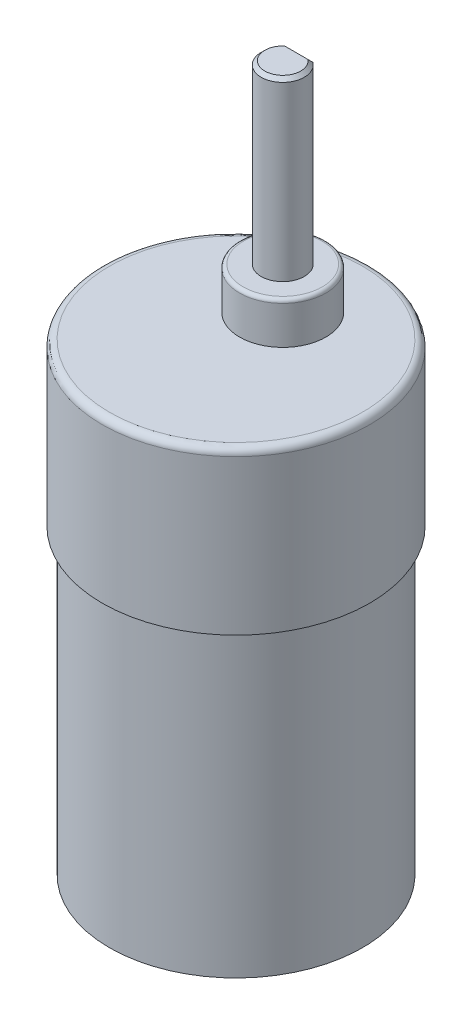
ISO-10303-21;
HEADER;
FILE_DESCRIPTION(('STEP AP214'),'2;1');
FILE_NAME('part.step','',(''),(''),'','','');
FILE_SCHEMA(('AUTOMOTIVE_DESIGN { 1 0 10303 214 1 1 1 1 }'));
ENDSEC;
DATA;
#1=APPLICATION_CONTEXT('core data for automotive mechanical design processes');
#2=APPLICATION_PROTOCOL_DEFINITION('international standard','automotive_design',2000,#1);
#3=PRODUCT_CONTEXT('',#1,'mechanical');
#4=PRODUCT('Part','Part','',(#3));
#5=PRODUCT_RELATED_PRODUCT_CATEGORY('part','',(#4));
#6=PRODUCT_DEFINITION_FORMATION('','',#4);
#7=PRODUCT_DEFINITION_CONTEXT('part definition',#1,'design');
#8=PRODUCT_DEFINITION('design','',#6,#7);
#9=PRODUCT_DEFINITION_SHAPE('','',#8);
#10=(LENGTH_UNIT() NAMED_UNIT(*) SI_UNIT(.MILLI.,.METRE.));
#11=(NAMED_UNIT(*) PLANE_ANGLE_UNIT() SI_UNIT($,.RADIAN.));
#12=(NAMED_UNIT(*) SI_UNIT($,.STERADIAN.) SOLID_ANGLE_UNIT());
#13=UNCERTAINTY_MEASURE_WITH_UNIT(LENGTH_MEASURE(1.E-05),#10,'distance_accuracy_value','');
#14=(GEOMETRIC_REPRESENTATION_CONTEXT(3) GLOBAL_UNCERTAINTY_ASSIGNED_CONTEXT((#13)) GLOBAL_UNIT_ASSIGNED_CONTEXT((#10,
#11,#12)) REPRESENTATION_CONTEXT('',''));
#15=CARTESIAN_POINT('',(0.,0.,0.));
#16=DIRECTION('',(0.,0.,1.));
#17=DIRECTION('',(1.,0.,0.));
#18=AXIS2_PLACEMENT_3D('',#15,#16,#17);
#19=CARTESIAN_POINT('',(9.03438594613245,-46.,-9.8));
#20=DIRECTION('',(0.931562549804886,0.,0.363581099345139));
#21=DIRECTION('',(0.363581099345139,0.,-0.931562549804886));
#22=AXIS2_PLACEMENT_3D('',#19,#20,#21);
#23=PLANE('',#22);
#24=DIRECTION('',(0.363581099345139,0.,-0.931562549804886));
#25=VECTOR('',#24,1.);
#26=CARTESIAN_POINT('',(9.03438594613245,-46.,-9.8));
#27=LINE('',#26,#25);
#28=CARTESIAN_POINT('',(8.12543319776952,-46.,-7.47109362548758));
#29=VERTEX_POINT('',#28);
#30=CARTESIAN_POINT('',(8.85259539645988,-46.,-9.33421872509756));
#31=VERTEX_POINT('',#30);
#32=EDGE_CURVE('E207',#29,#31,#27,.T.);
#33=ORIENTED_EDGE('',*,*,#32,.F.);
#34=DIRECTION('',(0.257090660858204,-0.707106781186558,-0.658714196066456));
#35=VECTOR('',#34,1.);
#36=CARTESIAN_POINT('',(8.12543319776952,-46.,-7.47109362548758));
#37=LINE('',#36,#35);
#38=CARTESIAN_POINT('',(7.94364264809696,-45.5,-7.00531235058515));
#39=VERTEX_POINT('',#38);
#40=EDGE_CURVE('E290',#29,#39,#37,.F.);
#41=ORIENTED_EDGE('',*,*,#40,.T.);
#42=DIRECTION('',(0.,1.,0.));
#43=VECTOR('',#42,1.);
#44=CARTESIAN_POINT('',(7.94364264809696,-46.,-7.00531235058515));
#45=LINE('',#44,#43);
#46=CARTESIAN_POINT('',(7.94364264809696,-41.,-7.00531235058515));
#47=VERTEX_POINT('',#46);
#48=EDGE_CURVE('E185',#39,#47,#45,.T.);
#49=ORIENTED_EDGE('',*,*,#48,.T.);
#50=DIRECTION('',(0.363581099345139,0.,-0.931562549804886));
#51=VECTOR('',#50,1.);
#52=CARTESIAN_POINT('',(9.03438594613245,-41.,-9.8));
#53=LINE('',#52,#51);
#54=CARTESIAN_POINT('',(9.03438594613245,-41.,-9.8));
#55=VERTEX_POINT('',#54);
#56=EDGE_CURVE('E181',#47,#55,#53,.T.);
#57=ORIENTED_EDGE('',*,*,#56,.T.);
#58=DIRECTION('',(0.,1.,0.));
#59=VECTOR('',#58,1.);
#60=CARTESIAN_POINT('',(9.03438594613245,-46.,-9.8));
#61=LINE('',#60,#59);
#62=CARTESIAN_POINT('',(9.03438594613245,-45.5,-9.8));
#63=VERTEX_POINT('',#62);
#64=EDGE_CURVE('E165',#63,#55,#61,.T.);
#65=ORIENTED_EDGE('',*,*,#64,.F.);
#66=DIRECTION('',(0.257090660858206,0.707106781186553,-0.65871419606646));
#67=VECTOR('',#66,1.);
#68=CARTESIAN_POINT('',(8.85259539645988,-46.,-9.33421872509756));
#69=LINE('',#68,#67);
#70=EDGE_CURVE('E287',#63,#31,#69,.F.);
#71=ORIENTED_EDGE('',*,*,#70,.T.);
#72=EDGE_LOOP('',(#33,#41,#49,#57,#65,#71));
#73=FACE_BOUND('',#72,.T.);
#74=CARTESIAN_POINT('',(8.48901429711467,-45.,-8.40265617529258));
#75=DIRECTION('',(0.931562549804886,0.,0.363581099345139));
#76=DIRECTION('',(0.363581099345139,0.,-0.931562549804886));
#77=AXIS2_PLACEMENT_3D('',#74,#75,#76);
#78=CIRCLE('',#77,0.500000000000004);
#79=CARTESIAN_POINT('',(8.67080484678724,-45.,-8.86843745019503));
#80=VERTEX_POINT('',#79);
#81=EDGE_CURVE('E519',#80,#80,#78,.T.);
#82=ORIENTED_EDGE('',*,*,#81,.T.);
#83=EDGE_LOOP('',(#82));
#84=FACE_BOUND('',#83,.T.);
#85=ADVANCED_FACE('F16',(#73,#84),#23,.F.);
#86=CARTESIAN_POINT('',(8.4094239229994,-46.,-6.82352180091257));
#87=DIRECTION('',(-0.931562549804876,0.,-0.363581099345163));
#88=DIRECTION('',(-0.363581099345163,0.,0.931562549804876));
#89=AXIS2_PLACEMENT_3D('',#86,#87,#88);
#90=PLANE('',#89);
#91=DIRECTION('',(0.,1.,0.));
#92=VECTOR('',#91,1.);
#93=CARTESIAN_POINT('',(8.4094239229994,-46.,-6.82352180091257));
#94=LINE('',#93,#92);
#95=CARTESIAN_POINT('',(8.4094239229994,-45.5,-6.82352180091257));
#96=VERTEX_POINT('',#95);
#97=CARTESIAN_POINT('',(8.4094239229994,-41.,-6.82352180091257));
#98=VERTEX_POINT('',#97);
#99=EDGE_CURVE('E210',#96,#98,#94,.T.);
#100=ORIENTED_EDGE('',*,*,#99,.F.);
#101=DIRECTION('',(-0.257090660858221,0.707106781186557,0.65871419606645));
#102=VECTOR('',#101,1.);
#103=CARTESIAN_POINT('',(8.59121447267197,-46.,-7.28930307581499));
#104=LINE('',#103,#102);
#105=CARTESIAN_POINT('',(8.59121447267197,-46.,-7.28930307581499));
#106=VERTEX_POINT('',#105);
#107=EDGE_CURVE('E298',#96,#106,#104,.F.);
#108=ORIENTED_EDGE('',*,*,#107,.T.);
#109=DIRECTION('',(-0.363581099345163,0.,0.931562549804876));
#110=VECTOR('',#109,1.);
#111=CARTESIAN_POINT('',(8.4094239229994,-46.,-6.82352180091257));
#112=LINE('',#111,#110);
#113=CARTESIAN_POINT('',(9.31837667136231,-46.,-9.15242817542476));
#114=VERTEX_POINT('',#113);
#115=EDGE_CURVE('E211',#114,#106,#112,.T.);
#116=ORIENTED_EDGE('',*,*,#115,.F.);
#117=DIRECTION('',(-0.257090660858222,-0.707106781186553,0.658714196066453));
#118=VECTOR('',#117,1.);
#119=CARTESIAN_POINT('',(9.31837667136235,-45.9999999999999,-9.15242817542486));
#120=LINE('',#119,#118);
#121=CARTESIAN_POINT('',(9.50016722103489,-45.5,-9.6182094503272));
#122=VERTEX_POINT('',#121);
#123=EDGE_CURVE('E295',#114,#122,#120,.F.);
#124=ORIENTED_EDGE('',*,*,#123,.T.);
#125=DIRECTION('',(0.,1.,0.));
#126=VECTOR('',#125,1.);
#127=CARTESIAN_POINT('',(9.50016722103489,-46.,-9.6182094503272));
#128=LINE('',#127,#126);
#129=CARTESIAN_POINT('',(9.50016722103489,-41.,-9.6182094503272));
#130=VERTEX_POINT('',#129);
#131=EDGE_CURVE('E178',#122,#130,#128,.T.);
#132=ORIENTED_EDGE('',*,*,#131,.T.);
#133=DIRECTION('',(-0.363581099345163,0.,0.931562549804876));
#134=VECTOR('',#133,1.);
#135=CARTESIAN_POINT('',(8.4094239229994,-41.,-6.82352180091257));
#136=LINE('',#135,#134);
#137=EDGE_CURVE('E194',#130,#98,#136,.T.);
#138=ORIENTED_EDGE('',*,*,#137,.T.);
#139=EDGE_LOOP('',(#100,#108,#116,#124,#132,#138));
#140=FACE_BOUND('',#139,.T.);
#141=CARTESIAN_POINT('',(8.95479557201718,-45.,-8.22086562561998));
#142=DIRECTION('',(-0.931562549804876,0.,-0.363581099345163));
#143=DIRECTION('',(-0.363581099345163,0.,0.931562549804876));
#144=AXIS2_PLACEMENT_3D('',#141,#142,#143);
#145=CIRCLE('',#144,0.500000000000004);
#146=CARTESIAN_POINT('',(8.7730050223446,-45.,-7.75508435071754));
#147=VERTEX_POINT('',#146);
#148=EDGE_CURVE('E522',#147,#147,#145,.F.);
#149=ORIENTED_EDGE('',*,*,#148,.F.);
#150=EDGE_LOOP('',(#149));
#151=FACE_BOUND('',#150,.T.);
#152=ADVANCED_FACE('F393',(#140,#151),#90,.F.);
#153=CARTESIAN_POINT('',(0.,52.8,-6.5));
#154=DIRECTION('',(0.,-1.,0.));
#155=DIRECTION('',(0.,0.,-1.));
#156=AXIS2_PLACEMENT_3D('',#153,#154,#155);
#157=CYLINDRICAL_SURFACE('',#156,3.);
#158=DIRECTION('',(0.,-1.,0.));
#159=VECTOR('',#158,1.);
#160=CARTESIAN_POINT('',(1.8,52.8,-8.9));
#161=LINE('',#160,#159);
#162=CARTESIAN_POINT('',(1.8,52.3,-8.9));
#163=VERTEX_POINT('',#162);
#164=CARTESIAN_POINT('',(1.79999999999999,28.3,-8.9));
#165=VERTEX_POINT('',#164);
#166=EDGE_CURVE('E365',#163,#165,#161,.T.);
#167=ORIENTED_EDGE('',*,*,#166,.F.);
#168=CARTESIAN_POINT('',(0.,52.3,-6.5));
#169=DIRECTION('',(0.,1.,0.));
#170=DIRECTION('',(0.,0.,1.));
#171=AXIS2_PLACEMENT_3D('',#168,#169,#170);
#172=CIRCLE('',#171,3.);
#173=CARTESIAN_POINT('',(-1.8,52.3,-8.9));
#174=VERTEX_POINT('',#173);
#175=EDGE_CURVE('E10',#163,#174,#172,.F.);
#176=ORIENTED_EDGE('',*,*,#175,.T.);
#177=DIRECTION('',(0.,-1.,0.));
#178=VECTOR('',#177,1.);
#179=CARTESIAN_POINT('',(-1.8,52.8,-8.9));
#180=LINE('',#179,#178);
#181=CARTESIAN_POINT('',(-1.8,28.3,-8.9));
#182=VERTEX_POINT('',#181);
#183=EDGE_CURVE('E362',#174,#182,#180,.T.);
#184=ORIENTED_EDGE('',*,*,#183,.T.);
#185=CARTESIAN_POINT('',(0.,28.3,-6.5));
#186=DIRECTION('',(0.,1.,0.));
#187=DIRECTION('',(0.,0.,1.));
#188=AXIS2_PLACEMENT_3D('',#185,#186,#187);
#189=CIRCLE('',#188,3.);
#190=EDGE_CURVE('E354',#182,#165,#189,.T.);
#191=ORIENTED_EDGE('',*,*,#190,.T.);
#192=EDGE_LOOP('',(#167,#176,#184,#191));
#193=FACE_BOUND('',#192,.T.);
#194=ADVANCED_FACE('F388',(#193),#157,.T.);
#195=CARTESIAN_POINT('',(-1.8,52.8,-8.9));
#196=DIRECTION('',(0.,0.,1.));
#197=DIRECTION('',(1.,0.,0.));
#198=AXIS2_PLACEMENT_3D('',#195,#196,#197);
#199=PLANE('',#198);
#200=ORIENTED_EDGE('',*,*,#183,.F.);
#201=DIRECTION('',(1.,0.,0.));
#202=VECTOR('',#201,1.);
#203=CARTESIAN_POINT('',(1.8,52.3,-8.9));
#204=LINE('',#203,#202);
#205=EDGE_CURVE('E30',#174,#163,#204,.T.);
#206=ORIENTED_EDGE('',*,*,#205,.T.);
#207=ORIENTED_EDGE('',*,*,#166,.T.);
#208=DIRECTION('',(-1.,0.,0.));
#209=VECTOR('',#208,1.);
#210=CARTESIAN_POINT('',(-1.8,28.3,-8.9));
#211=LINE('',#210,#209);
#212=EDGE_CURVE('E358',#165,#182,#211,.T.);
#213=ORIENTED_EDGE('',*,*,#212,.T.);
#214=EDGE_LOOP('',(#200,#206,#207,#213));
#215=FACE_BOUND('',#214,.T.);
#216=ADVANCED_FACE('F392',(#215),#199,.F.);
#217=CARTESIAN_POINT('',(0.,52.8,-6.5));
#218=DIRECTION('',(0.,1.,0.));
#219=DIRECTION('',(0.,0.,1.));
#220=AXIS2_PLACEMENT_3D('',#217,#218,#219);
#221=PLANE('',#220);
#222=CARTESIAN_POINT('',(0.,52.8,-6.5));
#223=DIRECTION('',(0.,1.,0.));
#224=DIRECTION('',(0.,0.,1.));
#225=AXIS2_PLACEMENT_3D('',#222,#223,#224);
#226=CIRCLE('',#225,2.5);
#227=CARTESIAN_POINT('',(-1.62480768092719,52.8,-8.4));
#228=VERTEX_POINT('',#227);
#229=CARTESIAN_POINT('',(1.62480768092719,52.8,-8.4));
#230=VERTEX_POINT('',#229);
#231=EDGE_CURVE('E369',#228,#230,#226,.T.);
#232=ORIENTED_EDGE('',*,*,#231,.T.);
#233=DIRECTION('',(-1.,0.,0.));
#234=VECTOR('',#233,1.);
#235=CARTESIAN_POINT('',(-1.8,52.8,-8.4));
#236=LINE('',#235,#234);
#237=EDGE_CURVE('E372',#230,#228,#236,.T.);
#238=ORIENTED_EDGE('',*,*,#237,.T.);
#239=EDGE_LOOP('',(#232,#238));
#240=FACE_BOUND('',#239,.T.);
#241=ADVANCED_FACE('F386',(#240),#221,.T.);
#242=CARTESIAN_POINT('',(0.,52.8,-6.5));
#243=DIRECTION('',(0.,-1.,0.));
#244=DIRECTION('',(0.,0.,-1.));
#245=AXIS2_PLACEMENT_3D('',#242,#243,#244);
#246=CONICAL_SURFACE('',#245,2.5,0.785398163397443);
#247=CARTESIAN_POINT('',(-1.62480768092719,52.8,-8.4));
#248=CARTESIAN_POINT('',(-1.65541292897536,52.7169127929639,-8.48308720703609));
#249=CARTESIAN_POINT('',(-1.68531495795293,52.6337023873582,-8.56629761264177));
#250=CARTESIAN_POINT('',(-1.74371238852874,52.4670357190947,-8.73296428090534));
#251=CARTESIAN_POINT('',(-1.7722077992421,52.3835794580337,-8.81642054196633));
#252=CARTESIAN_POINT('',(-1.8,52.3,-8.9));
#253=B_SPLINE_CURVE_WITH_KNOTS('',3,(#247,#248,#249,#250,#251,#252),.UNSPECIFIED.,.F.,.F.,(4,2,
4),(0.,0.36425083507371,0.728499309429532),.UNSPECIFIED.);
#254=EDGE_CURVE('E353',#174,#228,#253,.F.);
#255=ORIENTED_EDGE('',*,*,#254,.F.);
#256=ORIENTED_EDGE('',*,*,#175,.F.);
#257=CARTESIAN_POINT('',(1.8,52.3,-8.9));
#258=CARTESIAN_POINT('',(1.7722077992421,52.3835794580337,-8.81642054196633));
#259=CARTESIAN_POINT('',(1.74371238852874,52.4670357190947,-8.73296428090534));
#260=CARTESIAN_POINT('',(1.68531495795293,52.6337023873582,-8.56629761264177));
#261=CARTESIAN_POINT('',(1.65541292897536,52.7169127929639,-8.48308720703609));
#262=CARTESIAN_POINT('',(1.62480768092719,52.8,-8.4));
#263=B_SPLINE_CURVE_WITH_KNOTS('',3,(#257,#258,#259,#260,#261,#262),.UNSPECIFIED.,.F.,.F.,(4,2,
4),(0.,0.364248474355822,0.728499309429532),.UNSPECIFIED.);
#264=EDGE_CURVE('E21',#230,#163,#263,.F.);
#265=ORIENTED_EDGE('',*,*,#264,.F.);
#266=ORIENTED_EDGE('',*,*,#231,.F.);
#267=EDGE_LOOP('',(#255,#256,#265,#266));
#268=FACE_BOUND('',#267,.T.);
#269=ADVANCED_FACE('F382',(#268),#246,.T.);
#270=CARTESIAN_POINT('',(0.,52.8,-8.4));
#271=DIRECTION('',(0.,0.707106781186544,-0.707106781186551));
#272=DIRECTION('',(0.,0.707106781186551,0.707106781186544));
#273=AXIS2_PLACEMENT_3D('',#270,#271,#272);
#274=PLANE('',#273);
#275=ORIENTED_EDGE('',*,*,#264,.T.);
#276=ORIENTED_EDGE('',*,*,#205,.F.);
#277=ORIENTED_EDGE('',*,*,#254,.T.);
#278=ORIENTED_EDGE('',*,*,#237,.F.);
#279=EDGE_LOOP('',(#275,#276,#277,#278));
#280=FACE_BOUND('',#279,.T.);
#281=ADVANCED_FACE('F18',(#280),#274,.T.);
#282=CARTESIAN_POINT('',(0.,28.3,-6.5));
#283=DIRECTION('',(0.,1.,0.));
#284=DIRECTION('',(0.,0.,1.));
#285=AXIS2_PLACEMENT_3D('',#282,#283,#284);
#286=PLANE('',#285);
#287=CARTESIAN_POINT('',(0.,28.3,-6.5));
#288=DIRECTION('',(0.,1.,0.));
#289=DIRECTION('',(0.,0.,1.));
#290=AXIS2_PLACEMENT_3D('',#287,#288,#289);
#291=CIRCLE('',#290,5.5);
#292=CARTESIAN_POINT('',(0.,28.3,-0.999999999999998));
#293=VERTEX_POINT('',#292);
#294=EDGE_CURVE('E337',#293,#293,#291,.T.);
#295=ORIENTED_EDGE('',*,*,#294,.T.);
#296=EDGE_LOOP('',(#295));
#297=FACE_BOUND('',#296,.T.);
#298=ORIENTED_EDGE('',*,*,#190,.F.);
#299=ORIENTED_EDGE('',*,*,#212,.F.);
#300=EDGE_LOOP('',(#298,#299));
#301=FACE_BOUND('',#300,.T.);
#302=ADVANCED_FACE('F447',(#297,#301),#286,.T.);
#303=CARTESIAN_POINT('',(0.,-41.,0.));
#304=DIRECTION('',(0.,-1.,0.));
#305=DIRECTION('',(0.,0.,-1.));
#306=AXIS2_PLACEMENT_3D('',#303,#304,#305);
#307=PLANE('',#306);
#308=DIRECTION('',(-0.931562549804876,0.,0.363581099345164));
#309=VECTOR('',#308,1.);
#310=CARTESIAN_POINT('',(-8.40942392299948,-41.,-6.82352180091257));
#311=LINE('',#310,#309);
#312=CARTESIAN_POINT('',(-7.94364264809704,-41.,-7.00531235058515));
#313=VERTEX_POINT('',#312);
#314=CARTESIAN_POINT('',(-8.40942392299948,-41.,-6.82352180091257));
#315=VERTEX_POINT('',#314);
#316=EDGE_CURVE('E229',#313,#315,#311,.T.);
#317=ORIENTED_EDGE('',*,*,#316,.F.);
#318=DIRECTION('',(0.363581099345165,0.,0.931562549804876));
#319=VECTOR('',#318,1.);
#320=CARTESIAN_POINT('',(-7.94364264809704,-41.,-7.00531235058515));
#321=LINE('',#320,#319);
#322=CARTESIAN_POINT('',(-9.03438594613253,-41.,-9.79999999999979));
#323=VERTEX_POINT('',#322);
#324=EDGE_CURVE('E177',#323,#313,#321,.T.);
#325=ORIENTED_EDGE('',*,*,#324,.F.);
#326=DIRECTION('',(0.931562549804854,0.,-0.36358109934522));
#327=VECTOR('',#326,1.);
#328=CARTESIAN_POINT('',(-9.03438594613253,-41.,-9.79999999999979));
#329=LINE('',#328,#327);
#330=CARTESIAN_POINT('',(-9.50016722103496,-41.,-9.61820945032717));
#331=VERTEX_POINT('',#330);
#332=EDGE_CURVE('E221',#331,#323,#329,.T.);
#333=ORIENTED_EDGE('',*,*,#332,.F.);
#334=DIRECTION('',(-0.363581099345165,0.,-0.931562549804876));
#335=VECTOR('',#334,1.);
#336=CARTESIAN_POINT('',(-9.50016722103496,-41.,-9.61820945032718));
#337=LINE('',#336,#335);
#338=EDGE_CURVE('E233',#315,#331,#337,.T.);
#339=ORIENTED_EDGE('',*,*,#338,.F.);
#340=EDGE_LOOP('',(#317,#325,#333,#339));
#341=FACE_BOUND('',#340,.T.);
#342=CARTESIAN_POINT('',(0.,-41.,0.));
#343=DIRECTION('',(0.,-1.,0.));
#344=DIRECTION('',(0.,0.,-1.));
#345=AXIS2_PLACEMENT_3D('',#342,#343,#344);
#346=CIRCLE('',#345,17.);
#347=CARTESIAN_POINT('',(0.,-41.,-17.));
#348=VERTEX_POINT('',#347);
#349=EDGE_CURVE('E256',#348,#348,#346,.T.);
#350=ORIENTED_EDGE('',*,*,#349,.T.);
#351=EDGE_LOOP('',(#350));
#352=FACE_BOUND('',#351,.T.);
#353=CARTESIAN_POINT('',(0.,-41.,0.));
#354=DIRECTION('',(0.,-1.,0.));
#355=DIRECTION('',(0.,0.,-1.));
#356=AXIS2_PLACEMENT_3D('',#353,#354,#355);
#357=CIRCLE('',#356,4.9);
#358=CARTESIAN_POINT('',(0.,-41.,-4.9));
#359=VERTEX_POINT('',#358);
#360=EDGE_CURVE('E251',#359,#359,#357,.T.);
#361=ORIENTED_EDGE('',*,*,#360,.F.);
#362=EDGE_LOOP('',(#361));
#363=FACE_BOUND('',#362,.T.);
#364=DIRECTION('',(0.931562549804728,0.,0.363581099345543));
#365=VECTOR('',#364,1.);
#366=CARTESIAN_POINT('',(9.50016722103489,-41.,-9.6182094503272));
#367=LINE('',#366,#365);
#368=EDGE_CURVE('E170',#55,#130,#367,.T.);
#369=ORIENTED_EDGE('',*,*,#368,.F.);
#370=ORIENTED_EDGE('',*,*,#56,.F.);
#371=DIRECTION('',(-0.931562549804877,0.,-0.363581099345161));
#372=VECTOR('',#371,1.);
#373=CARTESIAN_POINT('',(7.94364264809696,-41.,-7.00531235058515));
#374=LINE('',#373,#372);
#375=EDGE_CURVE('E201',#98,#47,#374,.T.);
#376=ORIENTED_EDGE('',*,*,#375,.F.);
#377=ORIENTED_EDGE('',*,*,#137,.F.);
#378=EDGE_LOOP('',(#369,#370,#376,#377));
#379=FACE_BOUND('',#378,.T.);
#380=ADVANCED_FACE('F192',(#341,#352,#363,#379),#307,.T.);
#381=CARTESIAN_POINT('',(0.,0.,0.));
#382=DIRECTION('',(0.,1.,0.));
#383=DIRECTION('',(0.,0.,1.));
#384=AXIS2_PLACEMENT_3D('',#381,#382,#383);
#385=PLANE('',#384);
#386=CARTESIAN_POINT('',(0.,0.,0.));
#387=DIRECTION('',(0.,1.,0.));
#388=DIRECTION('',(0.,0.,1.));
#389=AXIS2_PLACEMENT_3D('',#386,#387,#388);
#390=CIRCLE('',#389,18.6);
#391=CARTESIAN_POINT('',(0.,0.,18.6));
#392=VERTEX_POINT('',#391);
#393=EDGE_CURVE('E271',#392,#392,#390,.T.);
#394=ORIENTED_EDGE('',*,*,#393,.F.);
#395=EDGE_LOOP('',(#394));
#396=FACE_BOUND('',#395,.T.);
#397=CARTESIAN_POINT('',(0.,0.,0.));
#398=DIRECTION('',(0.,1.,0.));
#399=DIRECTION('',(0.,0.,1.));
#400=AXIS2_PLACEMENT_3D('',#397,#398,#399);
#401=CIRCLE('',#400,17.6);
#402=CARTESIAN_POINT('',(0.,0.,17.6));
#403=VERTEX_POINT('',#402);
#404=EDGE_CURVE('E275',#403,#403,#401,.F.);
#405=ORIENTED_EDGE('',*,*,#404,.F.);
#406=EDGE_LOOP('',(#405));
#407=FACE_BOUND('',#406,.T.);
#408=ADVANCED_FACE('F436',(#396,#407),#385,.F.);
#409=CARTESIAN_POINT('',(0.,22.5,0.));
#410=DIRECTION('',(0.,1.,0.));
#411=DIRECTION('',(0.,0.,1.));
#412=AXIS2_PLACEMENT_3D('',#409,#410,#411);
#413=PLANE('',#412);
#414=CARTESIAN_POINT('',(0.,22.5,0.));
#415=DIRECTION('',(0.,1.,0.));
#416=DIRECTION('',(0.,0.,1.));
#417=AXIS2_PLACEMENT_3D('',#414,#415,#416);
#418=CIRCLE('',#417,17.6);
#419=CARTESIAN_POINT('',(0.,22.5,17.6));
#420=VERTEX_POINT('',#419);
#421=EDGE_CURVE('E329',#420,#420,#418,.T.);
#422=ORIENTED_EDGE('',*,*,#421,.T.);
#423=EDGE_LOOP('',(#422));
#424=FACE_BOUND('',#423,.T.);
#425=CARTESIAN_POINT('',(0.,22.5,-6.5));
#426=DIRECTION('',(0.,1.,0.));
#427=DIRECTION('',(0.,0.,1.));
#428=AXIS2_PLACEMENT_3D('',#425,#426,#427);
#429=CIRCLE('',#428,6.);
#430=CARTESIAN_POINT('',(0.,22.5,-0.499999999999999));
#431=VERTEX_POINT('',#430);
#432=EDGE_CURVE('E267',#431,#431,#429,.T.);
#433=ORIENTED_EDGE('',*,*,#432,.F.);
#434=EDGE_LOOP('',(#433));
#435=FACE_BOUND('',#434,.T.);
#436=ADVANCED_FACE('F434',(#424,#435),#413,.T.);
#437=CARTESIAN_POINT('',(0.,22.5,0.));
#438=DIRECTION('',(0.,-1.,0.));
#439=DIRECTION('',(0.,0.,-1.));
#440=AXIS2_PLACEMENT_3D('',#437,#438,#439);
#441=CYLINDRICAL_SURFACE('',#440,18.6);
#442=CARTESIAN_POINT('',(0.,21.5,0.));
#443=DIRECTION('',(0.,1.,0.));
#444=DIRECTION('',(0.,0.,1.));
#445=AXIS2_PLACEMENT_3D('',#442,#443,#444);
#446=CIRCLE('',#445,18.6);
#447=CARTESIAN_POINT('',(0.,21.5,18.6));
#448=VERTEX_POINT('',#447);
#449=EDGE_CURVE('E333',#448,#448,#446,.F.);
#450=ORIENTED_EDGE('',*,*,#449,.T.);
#451=EDGE_LOOP('',(#450));
#452=FACE_BOUND('',#451,.T.);
#453=ORIENTED_EDGE('',*,*,#393,.T.);
#454=EDGE_LOOP('',(#453));
#455=FACE_BOUND('',#454,.T.);
#456=ADVANCED_FACE('F430',(#452,#455),#441,.T.);
#457=CARTESIAN_POINT('',(0.,28.3,-6.5));
#458=DIRECTION('',(0.,-1.,0.));
#459=DIRECTION('',(0.,0.,-1.));
#460=AXIS2_PLACEMENT_3D('',#457,#458,#459);
#461=CYLINDRICAL_SURFACE('',#460,6.);
#462=CARTESIAN_POINT('',(0.,27.8,-6.5));
#463=DIRECTION('',(0.,1.,0.));
#464=DIRECTION('',(0.,0.,1.));
#465=AXIS2_PLACEMENT_3D('',#462,#463,#464);
#466=CIRCLE('',#465,6.);
#467=CARTESIAN_POINT('',(0.,27.8,-0.499999999999999));
#468=VERTEX_POINT('',#467);
#469=EDGE_CURVE('E341',#468,#468,#466,.F.);
#470=ORIENTED_EDGE('',*,*,#469,.T.);
#471=EDGE_LOOP('',(#470));
#472=FACE_BOUND('',#471,.T.);
#473=ORIENTED_EDGE('',*,*,#432,.T.);
#474=EDGE_LOOP('',(#473));
#475=FACE_BOUND('',#474,.T.);
#476=ADVANCED_FACE('F433',(#472,#475),#461,.T.);
#477=CARTESIAN_POINT('',(0.,-42.,0.));
#478=DIRECTION('',(0.,1.,0.));
#479=DIRECTION('',(0.,0.,1.));
#480=AXIS2_PLACEMENT_3D('',#477,#478,#479);
#481=CYLINDRICAL_SURFACE('',#480,17.6);
#482=CARTESIAN_POINT('',(0.,-42.,0.));
#483=DIRECTION('',(0.,-1.,0.));
#484=DIRECTION('',(0.,0.,-1.));
#485=AXIS2_PLACEMENT_3D('',#482,#483,#484);
#486=CIRCLE('',#485,17.6);
#487=CARTESIAN_POINT('',(0.,-42.,-17.6));
#488=VERTEX_POINT('',#487);
#489=EDGE_CURVE('E260',#488,#488,#486,.T.);
#490=ORIENTED_EDGE('',*,*,#489,.F.);
#491=EDGE_LOOP('',(#490));
#492=FACE_BOUND('',#491,.T.);
#493=ORIENTED_EDGE('',*,*,#404,.T.);
#494=EDGE_LOOP('',(#493));
#495=FACE_BOUND('',#494,.T.);
#496=ADVANCED_FACE('F445',(#492,#495),#481,.T.);
#497=CARTESIAN_POINT('',(0.,-42.,0.));
#498=DIRECTION('',(0.,-1.,0.));
#499=DIRECTION('',(0.,0.,-1.));
#500=AXIS2_PLACEMENT_3D('',#497,#498,#499);
#501=PLANE('',#500);
#502=CARTESIAN_POINT('',(0.,-42.,0.));
#503=DIRECTION('',(0.,-1.,0.));
#504=DIRECTION('',(0.,0.,-1.));
#505=AXIS2_PLACEMENT_3D('',#502,#503,#504);
#506=CIRCLE('',#505,17.);
#507=CARTESIAN_POINT('',(0.,-42.,-17.));
#508=VERTEX_POINT('',#507);
#509=EDGE_CURVE('E255',#508,#508,#506,.T.);
#510=ORIENTED_EDGE('',*,*,#509,.F.);
#511=EDGE_LOOP('',(#510));
#512=FACE_BOUND('',#511,.T.);
#513=ORIENTED_EDGE('',*,*,#489,.T.);
#514=EDGE_LOOP('',(#513));
#515=FACE_BOUND('',#514,.T.);
#516=ADVANCED_FACE('F453',(#512,#515),#501,.T.);
#517=CARTESIAN_POINT('',(0.,-41.,0.));
#518=DIRECTION('',(0.,-1.,0.));
#519=DIRECTION('',(0.,0.,-1.));
#520=AXIS2_PLACEMENT_3D('',#517,#518,#519);
#521=CYLINDRICAL_SURFACE('',#520,17.);
#522=ORIENTED_EDGE('',*,*,#349,.F.);
#523=EDGE_LOOP('',(#522));
#524=FACE_BOUND('',#523,.T.);
#525=ORIENTED_EDGE('',*,*,#509,.T.);
#526=EDGE_LOOP('',(#525));
#527=FACE_BOUND('',#526,.T.);
#528=ADVANCED_FACE('F457',(#524,#527),#521,.F.);
#529=CARTESIAN_POINT('',(0.,-44.7,0.));
#530=DIRECTION('',(0.,1.,0.));
#531=DIRECTION('',(0.,0.,1.));
#532=AXIS2_PLACEMENT_3D('',#529,#530,#531);
#533=CYLINDRICAL_SURFACE('',#532,4.9);
#534=CARTESIAN_POINT('',(0.,-42.7,0.));
#535=DIRECTION('',(0.,-1.,0.));
#536=DIRECTION('',(0.,0.,-1.));
#537=AXIS2_PLACEMENT_3D('',#534,#535,#536);
#538=CIRCLE('',#537,4.9);
#539=CARTESIAN_POINT('',(0.,-42.7,-4.9));
#540=VERTEX_POINT('',#539);
#541=EDGE_CURVE('E349',#540,#540,#538,.F.);
#542=ORIENTED_EDGE('',*,*,#541,.T.);
#543=EDGE_LOOP('',(#542));
#544=FACE_BOUND('',#543,.T.);
#545=ORIENTED_EDGE('',*,*,#360,.T.);
#546=EDGE_LOOP('',(#545));
#547=FACE_BOUND('',#546,.T.);
#548=ADVANCED_FACE('F461',(#544,#547),#533,.T.);
#549=CARTESIAN_POINT('',(0.,-44.7,0.));
#550=DIRECTION('',(0.,-1.,0.));
#551=DIRECTION('',(0.,0.,-1.));
#552=AXIS2_PLACEMENT_3D('',#549,#550,#551);
#553=PLANE('',#552);
#554=CARTESIAN_POINT('',(0.,-44.7,0.));
#555=DIRECTION('',(0.,-1.,0.));
#556=DIRECTION('',(0.,0.,-1.));
#557=AXIS2_PLACEMENT_3D('',#554,#555,#556);
#558=CIRCLE('',#557,2.9);
#559=CARTESIAN_POINT('',(0.,-44.7,-2.9));
#560=VERTEX_POINT('',#559);
#561=EDGE_CURVE('E345',#560,#560,#558,.T.);
#562=ORIENTED_EDGE('',*,*,#561,.T.);
#563=EDGE_LOOP('',(#562));
#564=FACE_BOUND('',#563,.T.);
#565=ADVANCED_FACE('F468',(#564),#553,.T.);
#566=CARTESIAN_POINT('',(-7.94364264809704,-46.,-7.00531235058515));
#567=DIRECTION('',(-0.931562549804876,0.,0.363581099345165));
#568=DIRECTION('',(0.363581099345165,0.,0.931562549804876));
#569=AXIS2_PLACEMENT_3D('',#566,#567,#568);
#570=PLANE('',#569);
#571=CARTESIAN_POINT('',(-8.48901429711479,-45.,-8.40265617529247));
#572=DIRECTION('',(0.931562549804876,0.,-0.363581099345165));
#573=DIRECTION('',(-0.363581099345165,0.,-0.931562549804876));
#574=AXIS2_PLACEMENT_3D('',#571,#572,#573);
#575=CIRCLE('',#574,0.500000000000001);
#576=CARTESIAN_POINT('',(-8.67080484678737,-45.,-8.86843745019491));
#577=VERTEX_POINT('',#576);
#578=EDGE_CURVE('E525',#577,#577,#575,.T.);
#579=ORIENTED_EDGE('',*,*,#578,.F.);
#580=EDGE_LOOP('',(#579));
#581=FACE_BOUND('',#580,.T.);
#582=DIRECTION('',(0.,1.,0.));
#583=VECTOR('',#582,1.);
#584=CARTESIAN_POINT('',(-7.94364264809704,-46.,-7.00531235058515));
#585=LINE('',#584,#583);
#586=CARTESIAN_POINT('',(-7.94364264809704,-45.5,-7.00531235058515));
#587=VERTEX_POINT('',#586);
#588=EDGE_CURVE('E248',#587,#313,#585,.T.);
#589=ORIENTED_EDGE('',*,*,#588,.F.);
#590=DIRECTION('',(-0.257090660858224,-0.707106781186552,-0.658714196066455));
#591=VECTOR('',#590,1.);
#592=CARTESIAN_POINT('',(-8.12543319776962,-46.,-7.47109362548759));
#593=LINE('',#592,#591);
#594=CARTESIAN_POINT('',(-8.12543319776962,-46.,-7.47109362548759));
#595=VERTEX_POINT('',#594);
#596=EDGE_CURVE('E323',#587,#595,#593,.T.);
#597=ORIENTED_EDGE('',*,*,#596,.T.);
#598=DIRECTION('',(0.363581099345165,0.,0.931562549804876));
#599=VECTOR('',#598,1.);
#600=CARTESIAN_POINT('',(-7.94364264809704,-46.,-7.00531235058515));
#601=LINE('',#600,#599);
#602=CARTESIAN_POINT('',(-8.85259539645996,-46.,-9.33421872509737));
#603=VERTEX_POINT('',#602);
#604=EDGE_CURVE('E216',#603,#595,#601,.T.);
#605=ORIENTED_EDGE('',*,*,#604,.F.);
#606=DIRECTION('',(-0.257090660858224,0.707106781186554,-0.658714196066453));
#607=VECTOR('',#606,1.);
#608=CARTESIAN_POINT('',(-8.85259539645996,-46.,-9.33421872509737));
#609=LINE('',#608,#607);
#610=CARTESIAN_POINT('',(-9.03438594613253,-45.5,-9.79999999999979));
#611=VERTEX_POINT('',#610);
#612=EDGE_CURVE('E320',#603,#611,#609,.T.);
#613=ORIENTED_EDGE('',*,*,#612,.T.);
#614=DIRECTION('',(0.,1.,0.));
#615=VECTOR('',#614,1.);
#616=CARTESIAN_POINT('',(-9.03438594613253,-46.,-9.79999999999979));
#617=LINE('',#616,#615);
#618=EDGE_CURVE('E225',#611,#323,#617,.T.);
#619=ORIENTED_EDGE('',*,*,#618,.T.);
#620=ORIENTED_EDGE('',*,*,#324,.T.);
#621=EDGE_LOOP('',(#589,#597,#605,#613,#619,#620));
#622=FACE_BOUND('',#621,.T.);
#623=ADVANCED_FACE('F472',(#581,#622),#570,.F.);
#624=CARTESIAN_POINT('',(-8.40942392299948,-46.,-6.82352180091257));
#625=DIRECTION('',(-0.363581099345164,0.,-0.931562549804876));
#626=DIRECTION('',(-0.931562549804876,0.,0.363581099345165));
#627=AXIS2_PLACEMENT_3D('',#624,#625,#626);
#628=PLANE('',#627);
#629=DIRECTION('',(0.,1.,0.));
#630=VECTOR('',#629,1.);
#631=CARTESIAN_POINT('',(-8.40942392299948,-46.,-6.82352180091257));
#632=LINE('',#631,#630);
#633=CARTESIAN_POINT('',(-8.40942392299948,-45.5,-6.82352180091257));
#634=VERTEX_POINT('',#633);
#635=EDGE_CURVE('E245',#634,#315,#632,.T.);
#636=ORIENTED_EDGE('',*,*,#635,.F.);
#637=DIRECTION('',(0.931562549804876,0.,-0.363581099345165));
#638=VECTOR('',#637,1.);
#639=CARTESIAN_POINT('',(-7.94364264809704,-45.5,-7.00531235058515));
#640=LINE('',#639,#638);
#641=EDGE_CURVE('E317',#634,#587,#640,.T.);
#642=ORIENTED_EDGE('',*,*,#641,.T.);
#643=ORIENTED_EDGE('',*,*,#588,.T.);
#644=ORIENTED_EDGE('',*,*,#316,.T.);
#645=EDGE_LOOP('',(#636,#642,#643,#644));
#646=FACE_BOUND('',#645,.T.);
#647=ADVANCED_FACE('F476',(#646),#628,.F.);
#648=CARTESIAN_POINT('',(-9.50016722103496,-46.,-9.61820945032718));
#649=DIRECTION('',(0.931562549804876,0.,-0.363581099345165));
#650=DIRECTION('',(-0.363581099345165,0.,-0.931562549804876));
#651=AXIS2_PLACEMENT_3D('',#648,#649,#650);
#652=PLANE('',#651);
#653=CARTESIAN_POINT('',(-8.95479557201723,-45.,-8.22086562561988));
#654=DIRECTION('',(0.931562549804876,0.,-0.363581099345165));
#655=DIRECTION('',(-0.363581099345165,0.,-0.931562549804876));
#656=AXIS2_PLACEMENT_3D('',#653,#654,#655);
#657=CIRCLE('',#656,0.500000000000001);
#658=CARTESIAN_POINT('',(-9.13658612168981,-45.,-8.68664690052232));
#659=VERTEX_POINT('',#658);
#660=EDGE_CURVE('E190',#659,#659,#657,.T.);
#661=ORIENTED_EDGE('',*,*,#660,.T.);
#662=EDGE_LOOP('',(#661));
#663=FACE_BOUND('',#662,.T.);
#664=DIRECTION('',(-0.363581099345165,0.,-0.931562549804876));
#665=VECTOR('',#664,1.);
#666=CARTESIAN_POINT('',(-9.50016722103496,-46.,-9.61820945032718));
#667=LINE('',#666,#665);
#668=CARTESIAN_POINT('',(-8.59121447267206,-46.,-7.289303075815));
#669=VERTEX_POINT('',#668);
#670=CARTESIAN_POINT('',(-9.31837667136239,-46.,-9.15242817542476));
#671=VERTEX_POINT('',#670);
#672=EDGE_CURVE('E220',#669,#671,#667,.T.);
#673=ORIENTED_EDGE('',*,*,#672,.F.);
#674=DIRECTION('',(0.257090660858224,0.707106781186552,0.658714196066455));
#675=VECTOR('',#674,1.);
#676=CARTESIAN_POINT('',(-8.59121447267206,-46.,-7.289303075815));
#677=LINE('',#676,#675);
#678=EDGE_CURVE('E314',#669,#634,#677,.T.);
#679=ORIENTED_EDGE('',*,*,#678,.T.);
#680=ORIENTED_EDGE('',*,*,#635,.T.);
#681=ORIENTED_EDGE('',*,*,#338,.T.);
#682=DIRECTION('',(0.,1.,0.));
#683=VECTOR('',#682,1.);
#684=CARTESIAN_POINT('',(-9.50016722103496,-46.,-9.61820945032718));
#685=LINE('',#684,#683);
#686=CARTESIAN_POINT('',(-9.50016722103496,-45.5,-9.61820945032718));
#687=VERTEX_POINT('',#686);
#688=EDGE_CURVE('E242',#687,#331,#685,.T.);
#689=ORIENTED_EDGE('',*,*,#688,.F.);
#690=DIRECTION('',(0.257090660858224,-0.707106781186554,0.658714196066453));
#691=VECTOR('',#690,1.);
#692=CARTESIAN_POINT('',(-9.31837667136239,-46.,-9.15242817542477));
#693=LINE('',#692,#691);
#694=EDGE_CURVE('E311',#687,#671,#693,.T.);
#695=ORIENTED_EDGE('',*,*,#694,.T.);
#696=EDGE_LOOP('',(#673,#679,#680,#681,#689,#695));
#697=FACE_BOUND('',#696,.T.);
#698=ADVANCED_FACE('F480',(#663,#697),#652,.F.);
#699=CARTESIAN_POINT('',(-9.03438594613253,-46.,-9.79999999999979));
#700=DIRECTION('',(0.36358109934522,0.,0.931562549804854));
#701=DIRECTION('',(0.931562549804854,0.,-0.36358109934522));
#702=AXIS2_PLACEMENT_3D('',#699,#700,#701);
#703=PLANE('',#702);
#704=ORIENTED_EDGE('',*,*,#618,.F.);
#705=DIRECTION('',(-0.931562549804854,0.,0.36358109934522));
#706=VECTOR('',#705,1.);
#707=CARTESIAN_POINT('',(-9.50016722103496,-45.5,-9.61820945032718));
#708=LINE('',#707,#706);
#709=EDGE_CURVE('E326',#611,#687,#708,.T.);
#710=ORIENTED_EDGE('',*,*,#709,.T.);
#711=ORIENTED_EDGE('',*,*,#688,.T.);
#712=ORIENTED_EDGE('',*,*,#332,.T.);
#713=EDGE_LOOP('',(#704,#710,#711,#712));
#714=FACE_BOUND('',#713,.T.);
#715=ADVANCED_FACE('F484',(#714),#703,.F.);
#716=CARTESIAN_POINT('',(-7.94364264809704,-46.,-7.00531235058515));
#717=DIRECTION('',(0.,-1.,0.));
#718=DIRECTION('',(0.,0.,-1.));
#719=AXIS2_PLACEMENT_3D('',#716,#717,#718);
#720=PLANE('',#719);
#721=ORIENTED_EDGE('',*,*,#604,.T.);
#722=DIRECTION('',(-0.931562549804876,0.,0.363581099345165));
#723=VECTOR('',#722,1.);
#724=CARTESIAN_POINT('',(-8.59121447267206,-46.,-7.289303075815));
#725=LINE('',#724,#723);
#726=EDGE_CURVE('E307',#595,#669,#725,.T.);
#727=ORIENTED_EDGE('',*,*,#726,.T.);
#728=ORIENTED_EDGE('',*,*,#672,.T.);
#729=DIRECTION('',(0.931562549804854,0.,-0.36358109934522));
#730=VECTOR('',#729,1.);
#731=CARTESIAN_POINT('',(-8.85259539645993,-46.,-9.33421872509738));
#732=LINE('',#731,#730);
#733=EDGE_CURVE('E303',#671,#603,#732,.T.);
#734=ORIENTED_EDGE('',*,*,#733,.T.);
#735=EDGE_LOOP('',(#721,#727,#728,#734));
#736=FACE_BOUND('',#735,.T.);
#737=ADVANCED_FACE('F488',(#736),#720,.T.);
#738=CARTESIAN_POINT('',(9.50016722103489,-46.,-9.6182094503272));
#739=DIRECTION('',(-0.363581099345543,0.,0.931562549804728));
#740=DIRECTION('',(0.931562549804728,0.,0.363581099345543));
#741=AXIS2_PLACEMENT_3D('',#738,#739,#740);
#742=PLANE('',#741);
#743=ORIENTED_EDGE('',*,*,#131,.F.);
#744=DIRECTION('',(-0.931562549804728,0.,-0.363581099345543));
#745=VECTOR('',#744,1.);
#746=CARTESIAN_POINT('',(9.50016722103489,-45.5,-9.6182094503272));
#747=LINE('',#746,#745);
#748=EDGE_CURVE('E173',#122,#63,#747,.T.);
#749=ORIENTED_EDGE('',*,*,#748,.T.);
#750=ORIENTED_EDGE('',*,*,#64,.T.);
#751=ORIENTED_EDGE('',*,*,#368,.T.);
#752=EDGE_LOOP('',(#743,#749,#750,#751));
#753=FACE_BOUND('',#752,.T.);
#754=ADVANCED_FACE('F168',(#753),#742,.F.);
#755=CARTESIAN_POINT('',(7.94364264809696,-46.,-7.00531235058515));
#756=DIRECTION('',(0.363581099345161,0.,-0.931562549804877));
#757=DIRECTION('',(-0.931562549804877,0.,-0.363581099345161));
#758=AXIS2_PLACEMENT_3D('',#755,#756,#757);
#759=PLANE('',#758);
#760=ORIENTED_EDGE('',*,*,#48,.F.);
#761=DIRECTION('',(0.931562549804877,0.,0.363581099345161));
#762=VECTOR('',#761,1.);
#763=CARTESIAN_POINT('',(7.94364264809696,-45.5,-7.00531235058515));
#764=LINE('',#763,#762);
#765=EDGE_CURVE('E293',#39,#96,#764,.T.);
#766=ORIENTED_EDGE('',*,*,#765,.T.);
#767=ORIENTED_EDGE('',*,*,#99,.T.);
#768=ORIENTED_EDGE('',*,*,#375,.T.);
#769=EDGE_LOOP('',(#760,#766,#767,#768));
#770=FACE_BOUND('',#769,.T.);
#771=ADVANCED_FACE('F497',(#770),#759,.F.);
#772=CARTESIAN_POINT('',(7.94364264809696,-46.,-7.00531235058515));
#773=DIRECTION('',(0.,1.,0.));
#774=DIRECTION('',(0.,0.,1.));
#775=AXIS2_PLACEMENT_3D('',#772,#773,#774);
#776=PLANE('',#775);
#777=ORIENTED_EDGE('',*,*,#115,.T.);
#778=DIRECTION('',(-0.931562549804877,0.,-0.363581099345161));
#779=VECTOR('',#778,1.);
#780=CARTESIAN_POINT('',(8.12543319776954,-46.,-7.47109362548757));
#781=LINE('',#780,#779);
#782=EDGE_CURVE('E283',#106,#29,#781,.T.);
#783=ORIENTED_EDGE('',*,*,#782,.T.);
#784=ORIENTED_EDGE('',*,*,#32,.T.);
#785=DIRECTION('',(0.931562549804728,0.,0.363581099345543));
#786=VECTOR('',#785,1.);
#787=CARTESIAN_POINT('',(8.8525953964609,-46.,-9.33421872509717));
#788=LINE('',#787,#786);
#789=EDGE_CURVE('E279',#31,#114,#788,.T.);
#790=ORIENTED_EDGE('',*,*,#789,.T.);
#791=EDGE_LOOP('',(#777,#783,#784,#790));
#792=FACE_BOUND('',#791,.T.);
#793=ADVANCED_FACE('F428',(#792),#776,.F.);
#794=CARTESIAN_POINT('',(8.12543319776954,-46.,-7.47109362548757));
#795=DIRECTION('',(0.257090660858227,0.707106781186538,-0.658714196066469));
#796=DIRECTION('',(0.,0.681625476296557,0.731701243721433));
#797=AXIS2_PLACEMENT_3D('',#794,#795,#796);
#798=PLANE('',#797);
#799=ORIENTED_EDGE('',*,*,#107,.F.);
#800=ORIENTED_EDGE('',*,*,#765,.F.);
#801=ORIENTED_EDGE('',*,*,#40,.F.);
#802=ORIENTED_EDGE('',*,*,#782,.F.);
#803=EDGE_LOOP('',(#799,#800,#801,#802));
#804=FACE_BOUND('',#803,.T.);
#805=ADVANCED_FACE('F424',(#804),#798,.F.);
#806=CARTESIAN_POINT('',(8.8525953964609,-46.,-9.33421872509717));
#807=DIRECTION('',(-0.257090660858496,0.707106781186542,0.65871419606636));
#808=DIRECTION('',(0.,-0.681625476296494,0.731701243721491));
#809=AXIS2_PLACEMENT_3D('',#806,#807,#808);
#810=PLANE('',#809);
#811=ORIENTED_EDGE('',*,*,#70,.F.);
#812=ORIENTED_EDGE('',*,*,#748,.F.);
#813=ORIENTED_EDGE('',*,*,#123,.F.);
#814=ORIENTED_EDGE('',*,*,#789,.F.);
#815=EDGE_LOOP('',(#811,#812,#813,#814));
#816=FACE_BOUND('',#815,.T.);
#817=ADVANCED_FACE('F420',(#816),#810,.F.);
#818=CARTESIAN_POINT('',(-8.12543319776962,-46.,-7.47109362548759));
#819=DIRECTION('',(0.257090660858227,-0.707106781186543,0.658714196066462));
#820=DIRECTION('',(0.,-0.681625476296551,-0.731701243721439));
#821=AXIS2_PLACEMENT_3D('',#818,#819,#820);
#822=PLANE('',#821);
#823=ORIENTED_EDGE('',*,*,#596,.F.);
#824=ORIENTED_EDGE('',*,*,#641,.F.);
#825=ORIENTED_EDGE('',*,*,#678,.F.);
#826=ORIENTED_EDGE('',*,*,#726,.F.);
#827=EDGE_LOOP('',(#823,#824,#825,#826));
#828=FACE_BOUND('',#827,.T.);
#829=ADVANCED_FACE('F416',(#828),#822,.T.);
#830=CARTESIAN_POINT('',(-8.8525953964601,-46.,-9.33421872509732));
#831=DIRECTION('',(-0.257090660858267,-0.707106781186541,-0.658714196066449));
#832=DIRECTION('',(0.,0.681625476296544,-0.731701243721445));
#833=AXIS2_PLACEMENT_3D('',#830,#831,#832);
#834=PLANE('',#833);
#835=ORIENTED_EDGE('',*,*,#694,.F.);
#836=ORIENTED_EDGE('',*,*,#709,.F.);
#837=ORIENTED_EDGE('',*,*,#612,.F.);
#838=ORIENTED_EDGE('',*,*,#733,.F.);
#839=EDGE_LOOP('',(#835,#836,#837,#838));
#840=FACE_BOUND('',#839,.T.);
#841=ADVANCED_FACE('F412',(#840),#834,.T.);
#842=CARTESIAN_POINT('',(0.,21.5,0.));
#843=DIRECTION('',(0.,1.,0.));
#844=DIRECTION('',(0.,0.,1.));
#845=AXIS2_PLACEMENT_3D('',#842,#843,#844);
#846=TOROIDAL_SURFACE('',#845,17.6,1.);
#847=ORIENTED_EDGE('',*,*,#449,.F.);
#848=EDGE_LOOP('',(#847));
#849=FACE_BOUND('',#848,.T.);
#850=ORIENTED_EDGE('',*,*,#421,.F.);
#851=EDGE_LOOP('',(#850));
#852=FACE_BOUND('',#851,.T.);
#853=ADVANCED_FACE('F408',(#849,#852),#846,.T.);
#854=CARTESIAN_POINT('',(0.,27.8,-6.5));
#855=DIRECTION('',(0.,1.,0.));
#856=DIRECTION('',(0.,0.,1.));
#857=AXIS2_PLACEMENT_3D('',#854,#855,#856);
#858=TOROIDAL_SURFACE('',#857,5.5,0.5);
#859=ORIENTED_EDGE('',*,*,#469,.F.);
#860=EDGE_LOOP('',(#859));
#861=FACE_BOUND('',#860,.T.);
#862=ORIENTED_EDGE('',*,*,#294,.F.);
#863=EDGE_LOOP('',(#862));
#864=FACE_BOUND('',#863,.T.);
#865=ADVANCED_FACE('F404',(#861,#864),#858,.T.);
#866=CARTESIAN_POINT('',(0.,-42.7,0.));
#867=DIRECTION('',(0.,-1.,0.));
#868=DIRECTION('',(0.,0.,-1.));
#869=AXIS2_PLACEMENT_3D('',#866,#867,#868);
#870=TOROIDAL_SURFACE('',#869,2.9,2.);
#871=ORIENTED_EDGE('',*,*,#541,.F.);
#872=EDGE_LOOP('',(#871));
#873=FACE_BOUND('',#872,.T.);
#874=ORIENTED_EDGE('',*,*,#561,.F.);
#875=EDGE_LOOP('',(#874));
#876=FACE_BOUND('',#875,.T.);
#877=ADVANCED_FACE('F400',(#873,#876),#870,.T.);
#878=CARTESIAN_POINT('',(-26.4091766207762,-45.,-1.40856617087424));
#879=DIRECTION('',(0.931562549804876,0.,-0.363581099345165));
#880=DIRECTION('',(-0.363581099345165,0.,-0.931562549804876));
#881=AXIS2_PLACEMENT_3D('',#878,#879,#880);
#882=CYLINDRICAL_SURFACE('',#881,0.500000000000001);
#883=ORIENTED_EDGE('',*,*,#578,.T.);
#884=EDGE_LOOP('',(#883));
#885=FACE_BOUND('',#884,.T.);
#886=ORIENTED_EDGE('',*,*,#660,.F.);
#887=EDGE_LOOP('',(#886));
#888=FACE_BOUND('',#887,.T.);
#889=ADVANCED_FACE('F403',(#885,#888),#882,.F.);
#890=CARTESIAN_POINT('',(26.4091766207759,-45.,-1.40856617087501));
#891=DIRECTION('',(-0.931562549804886,0.,-0.363581099345139));
#892=DIRECTION('',(-0.363581099345139,0.,0.931562549804886));
#893=AXIS2_PLACEMENT_3D('',#890,#891,#892);
#894=CYLINDRICAL_SURFACE('',#893,0.500000000000004);
#895=ORIENTED_EDGE('',*,*,#81,.F.);
#896=EDGE_LOOP('',(#895));
#897=FACE_BOUND('',#896,.T.);
#898=ORIENTED_EDGE('',*,*,#148,.T.);
#899=EDGE_LOOP('',(#898));
#900=FACE_BOUND('',#899,.T.);
#901=ADVANCED_FACE('F509',(#897,#900),#894,.F.);
#902=CLOSED_SHELL('',(#85,#152,#194,#216,#241,#269,#281,#302,#380,#408,#436,#456,#476,#496,#516,
#528,#548,#565,#623,#647,#698,#715,#737,#754,#771,#793,#805,#817,#829,#841,#853,#865,#877,#889,#901));
#903=MANIFOLD_SOLID_BREP('B1',#902);
#904=ADVANCED_BREP_SHAPE_REPRESENTATION('',(#18,#903),#14);
#905=SHAPE_DEFINITION_REPRESENTATION(#9,#904);
ENDSEC;
END-ISO-10303-21;
